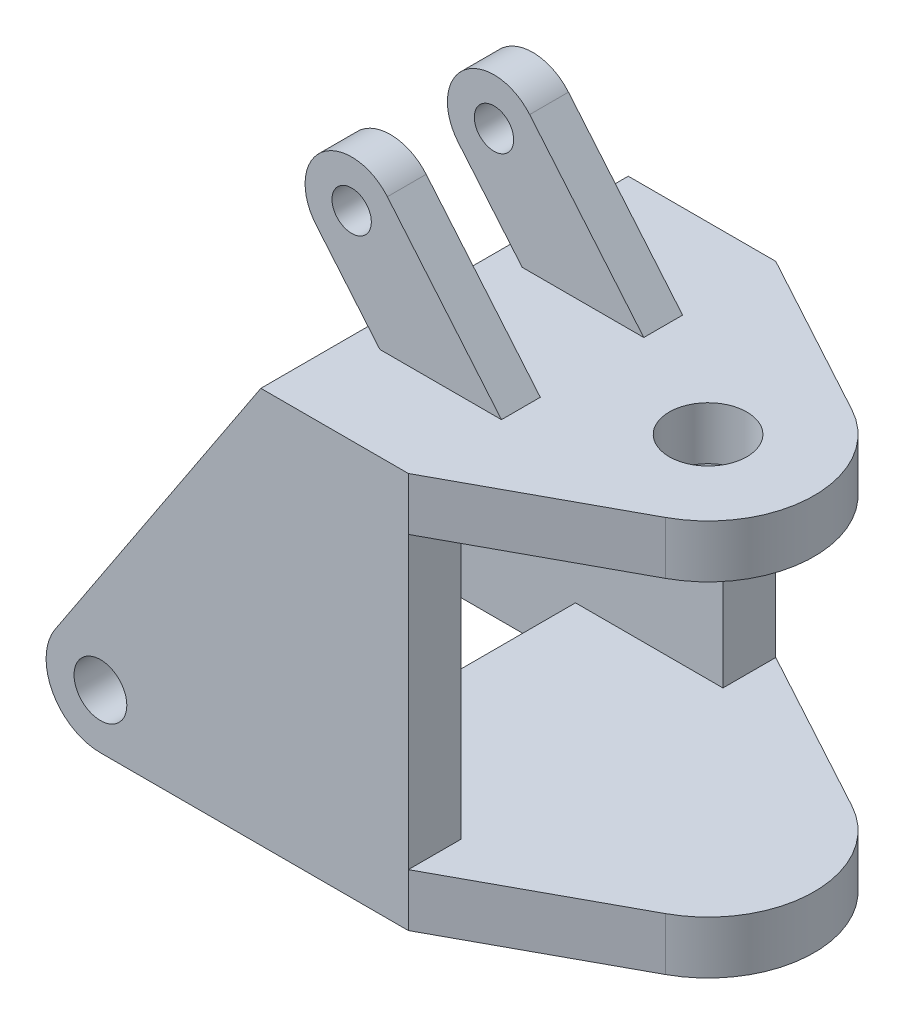
ISO-10303-21;
HEADER;
FILE_DESCRIPTION(('STEP AP214'),'2;1');
FILE_NAME('part.step','',(''),(''),'','','');
FILE_SCHEMA(('AUTOMOTIVE_DESIGN { 1 0 10303 214 1 1 1 1 }'));
ENDSEC;
DATA;
#1=APPLICATION_CONTEXT('core data for automotive mechanical design processes');
#2=APPLICATION_PROTOCOL_DEFINITION('international standard','automotive_design',2000,#1);
#3=PRODUCT_CONTEXT('',#1,'mechanical');
#4=PRODUCT('Part','Part','',(#3));
#5=PRODUCT_RELATED_PRODUCT_CATEGORY('part','',(#4));
#6=PRODUCT_DEFINITION_FORMATION('','',#4);
#7=PRODUCT_DEFINITION_CONTEXT('part definition',#1,'design');
#8=PRODUCT_DEFINITION('design','',#6,#7);
#9=PRODUCT_DEFINITION_SHAPE('','',#8);
#10=(LENGTH_UNIT() NAMED_UNIT(*) SI_UNIT(.MILLI.,.METRE.));
#11=(NAMED_UNIT(*) PLANE_ANGLE_UNIT() SI_UNIT($,.RADIAN.));
#12=(NAMED_UNIT(*) SI_UNIT($,.STERADIAN.) SOLID_ANGLE_UNIT());
#13=UNCERTAINTY_MEASURE_WITH_UNIT(LENGTH_MEASURE(1.E-05),#10,'distance_accuracy_value','');
#14=(GEOMETRIC_REPRESENTATION_CONTEXT(3) GLOBAL_UNCERTAINTY_ASSIGNED_CONTEXT((#13)) GLOBAL_UNIT_ASSIGNED_CONTEXT((#10,
#11,#12)) REPRESENTATION_CONTEXT('',''));
#15=CARTESIAN_POINT('',(0.,0.,0.));
#16=DIRECTION('',(0.,0.,1.));
#17=DIRECTION('',(1.,0.,0.));
#18=AXIS2_PLACEMENT_3D('',#15,#16,#17);
#19=CARTESIAN_POINT('',(-285.,765.,457.));
#20=DIRECTION('',(0.,-1.,0.));
#21=DIRECTION('',(0.,0.,-1.));
#22=AXIS2_PLACEMENT_3D('',#19,#20,#21);
#23=PLANE('',#22);
#24=DIRECTION('',(0.,0.,-1.));
#25=VECTOR('',#24,1.);
#26=CARTESIAN_POINT('',(-234.973312079811,765.,277.));
#27=LINE('',#26,#25);
#28=CARTESIAN_POINT('',(-234.973312079811,765.,277.));
#29=VERTEX_POINT('',#28);
#30=CARTESIAN_POINT('',(-234.973312079811,765.,202.));
#31=VERTEX_POINT('',#30);
#32=EDGE_CURVE('E285',#29,#31,#27,.T.);
#33=ORIENTED_EDGE('',*,*,#32,.T.);
#34=DIRECTION('',(1.,0.,0.));
#35=VECTOR('',#34,1.);
#36=CARTESIAN_POINT('',(-234.973312079811,765.,202.));
#37=LINE('',#36,#35);
#38=CARTESIAN_POINT('',(0.,765.,202.));
#39=VERTEX_POINT('',#38);
#40=EDGE_CURVE('E272',#31,#39,#37,.T.);
#41=ORIENTED_EDGE('',*,*,#40,.T.);
#42=DIRECTION('',(0.,0.,-1.));
#43=VECTOR('',#42,1.);
#44=CARTESIAN_POINT('',(0.,765.,277.));
#45=LINE('',#44,#43);
#46=CARTESIAN_POINT('',(0.,765.,277.));
#47=VERTEX_POINT('',#46);
#48=EDGE_CURVE('E282',#47,#39,#45,.T.);
#49=ORIENTED_EDGE('',*,*,#48,.F.);
#50=DIRECTION('',(1.,0.,0.));
#51=VECTOR('',#50,1.);
#52=CARTESIAN_POINT('',(-234.973312079811,765.,277.));
#53=LINE('',#52,#51);
#54=EDGE_CURVE('E56',#29,#47,#53,.T.);
#55=ORIENTED_EDGE('',*,*,#54,.F.);
#56=EDGE_LOOP('',(#33,#41,#49,#55));
#57=FACE_BOUND('',#56,.T.);
#58=DIRECTION('',(-0.878816619171536,0.,-0.477159669154794));
#59=VECTOR('',#58,1.);
#60=CARTESIAN_POINT('',(0.,765.,-253.));
#61=LINE('',#60,#59);
#62=CARTESIAN_POINT('',(322.019203343379,765.,-78.1574069301649));
#63=VERTEX_POINT('',#62);
#64=CARTESIAN_POINT('',(0.,765.,-253.));
#65=VERTEX_POINT('',#64);
#66=EDGE_CURVE('E389',#63,#65,#61,.T.);
#67=ORIENTED_EDGE('',*,*,#66,.T.);
#68=DIRECTION('',(-1.,0.,0.));
#69=VECTOR('',#68,1.);
#70=CARTESIAN_POINT('',(-285.,765.,-253.));
#71=LINE('',#70,#69);
#72=CARTESIAN_POINT('',(-285.,765.,-253.));
#73=VERTEX_POINT('',#72);
#74=EDGE_CURVE('E392',#65,#73,#71,.T.);
#75=ORIENTED_EDGE('',*,*,#74,.T.);
#76=DIRECTION('',(0.,0.,1.));
#77=VECTOR('',#76,1.);
#78=CARTESIAN_POINT('',(-285.,765.,457.));
#79=LINE('',#78,#77);
#80=CARTESIAN_POINT('',(-285.,765.,-151.));
#81=VERTEX_POINT('',#80);
#82=EDGE_CURVE('E375',#73,#81,#79,.T.);
#83=ORIENTED_EDGE('',*,*,#82,.T.);
#84=CARTESIAN_POINT('',(-285.,765.,355.));
#85=VERTEX_POINT('',#84);
#86=EDGE_CURVE('E394',#81,#85,#79,.T.);
#87=ORIENTED_EDGE('',*,*,#86,.T.);
#88=DIRECTION('',(0.,0.,-1.));
#89=VECTOR('',#88,1.);
#90=CARTESIAN_POINT('',(-285.,765.,457.));
#91=LINE('',#90,#89);
#92=CARTESIAN_POINT('',(-285.,765.,457.));
#93=VERTEX_POINT('',#92);
#94=EDGE_CURVE('E432',#93,#85,#91,.T.);
#95=ORIENTED_EDGE('',*,*,#94,.F.);
#96=DIRECTION('',(-1.,0.,0.));
#97=VECTOR('',#96,1.);
#98=CARTESIAN_POINT('',(-285.,765.,457.));
#99=LINE('',#98,#97);
#100=CARTESIAN_POINT('',(0.,765.,457.));
#101=VERTEX_POINT('',#100);
#102=EDGE_CURVE('E430',#101,#93,#99,.T.);
#103=ORIENTED_EDGE('',*,*,#102,.F.);
#104=DIRECTION('',(0.878816619171535,0.,-0.477159669154794));
#105=VECTOR('',#104,1.);
#106=CARTESIAN_POINT('',(322.019203343379,765.,282.157406930165));
#107=LINE('',#106,#105);
#108=CARTESIAN_POINT('',(322.019203343379,765.,282.157406930165));
#109=VERTEX_POINT('',#108);
#110=EDGE_CURVE('E368',#101,#109,#107,.T.);
#111=ORIENTED_EDGE('',*,*,#110,.T.);
#112=CARTESIAN_POINT('',(224.201471166647,765.,102.));
#113=DIRECTION('',(0.,1.,0.));
#114=DIRECTION('',(0.,0.,-1.));
#115=AXIS2_PLACEMENT_3D('',#112,#113,#114);
#116=CIRCLE('',#115,205.);
#117=EDGE_CURVE('E386',#109,#63,#116,.T.);
#118=ORIENTED_EDGE('',*,*,#117,.T.);
#119=EDGE_LOOP('',(#67,#75,#83,#87,#95,#103,#111,#118));
#120=FACE_BOUND('',#119,.T.);
#121=CARTESIAN_POINT('',(224.201471166647,765.,102.));
#122=DIRECTION('',(0.,1.,0.));
#123=DIRECTION('',(0.,0.,1.));
#124=AXIS2_PLACEMENT_3D('',#121,#122,#123);
#125=CIRCLE('',#124,75.);
#126=CARTESIAN_POINT('',(224.201471166647,765.,177.));
#127=VERTEX_POINT('',#126);
#128=EDGE_CURVE('E364',#127,#127,#125,.T.);
#129=ORIENTED_EDGE('',*,*,#128,.F.);
#130=EDGE_LOOP('',(#129));
#131=FACE_BOUND('',#130,.T.);
#132=DIRECTION('',(1.,0.,0.));
#133=VECTOR('',#132,1.);
#134=CARTESIAN_POINT('',(-234.973312079811,765.,-73.));
#135=LINE('',#134,#133);
#136=CARTESIAN_POINT('',(-234.973312079811,765.,-73.));
#137=VERTEX_POINT('',#136);
#138=CARTESIAN_POINT('',(0.,765.,-73.));
#139=VERTEX_POINT('',#138);
#140=EDGE_CURVE('E230',#137,#139,#135,.T.);
#141=ORIENTED_EDGE('',*,*,#140,.T.);
#142=DIRECTION('',(0.,0.,1.));
#143=VECTOR('',#142,1.);
#144=CARTESIAN_POINT('',(0.,765.,-73.));
#145=LINE('',#144,#143);
#146=CARTESIAN_POINT('',(0.,765.,1.99999999999997));
#147=VERTEX_POINT('',#146);
#148=EDGE_CURVE('E251',#139,#147,#145,.T.);
#149=ORIENTED_EDGE('',*,*,#148,.T.);
#150=DIRECTION('',(1.,0.,0.));
#151=VECTOR('',#150,1.);
#152=CARTESIAN_POINT('',(-234.973312079811,765.,1.99999999999997));
#153=LINE('',#152,#151);
#154=CARTESIAN_POINT('',(-234.973312079811,765.,1.99999999999999));
#155=VERTEX_POINT('',#154);
#156=EDGE_CURVE('E232',#155,#147,#153,.T.);
#157=ORIENTED_EDGE('',*,*,#156,.F.);
#158=DIRECTION('',(0.,0.,1.));
#159=VECTOR('',#158,1.);
#160=CARTESIAN_POINT('',(-234.973312079811,765.,-73.));
#161=LINE('',#160,#159);
#162=EDGE_CURVE('E241',#137,#155,#161,.T.);
#163=ORIENTED_EDGE('',*,*,#162,.F.);
#164=EDGE_LOOP('',(#141,#149,#157,#163));
#165=FACE_BOUND('',#164,.T.);
#166=ADVANCED_FACE('F33',(#57,#120,#131,#165),#23,.F.);
#167=CARTESIAN_POINT('',(0.,765.,457.));
#168=DIRECTION('',(-1.,0.,0.));
#169=DIRECTION('',(0.,0.,1.));
#170=AXIS2_PLACEMENT_3D('',#167,#168,#169);
#171=PLANE('',#170);
#172=DIRECTION('',(0.,0.,-1.));
#173=VECTOR('',#172,1.);
#174=CARTESIAN_POINT('',(0.,102.,457.));
#175=LINE('',#174,#173);
#176=CARTESIAN_POINT('',(0.,102.,457.));
#177=VERTEX_POINT('',#176);
#178=CARTESIAN_POINT('',(0.,102.,355.));
#179=VERTEX_POINT('',#178);
#180=EDGE_CURVE('E302',#177,#179,#175,.T.);
#181=ORIENTED_EDGE('',*,*,#180,.T.);
#182=DIRECTION('',(0.,1.,0.));
#183=VECTOR('',#182,1.);
#184=CARTESIAN_POINT('',(0.,765.,355.));
#185=LINE('',#184,#183);
#186=CARTESIAN_POINT('',(0.,663.,355.));
#187=VERTEX_POINT('',#186);
#188=EDGE_CURVE('E422',#179,#187,#185,.T.);
#189=ORIENTED_EDGE('',*,*,#188,.T.);
#190=DIRECTION('',(0.,0.,1.));
#191=VECTOR('',#190,1.);
#192=CARTESIAN_POINT('',(0.,663.,457.));
#193=LINE('',#192,#191);
#194=CARTESIAN_POINT('',(0.,663.,457.));
#195=VERTEX_POINT('',#194);
#196=EDGE_CURVE('E449',#187,#195,#193,.T.);
#197=ORIENTED_EDGE('',*,*,#196,.T.);
#198=DIRECTION('',(0.,1.,0.));
#199=VECTOR('',#198,1.);
#200=CARTESIAN_POINT('',(0.,765.,457.));
#201=LINE('',#200,#199);
#202=EDGE_CURVE('E426',#177,#195,#201,.T.);
#203=ORIENTED_EDGE('',*,*,#202,.F.);
#204=EDGE_LOOP('',(#181,#189,#197,#203));
#205=FACE_BOUND('',#204,.T.);
#206=ADVANCED_FACE('F515',(#205),#171,.F.);
#207=CARTESIAN_POINT('',(0.,765.,-253.));
#208=DIRECTION('',(1.,0.,0.));
#209=DIRECTION('',(0.,0.,-1.));
#210=AXIS2_PLACEMENT_3D('',#207,#208,#209);
#211=PLANE('',#210);
#212=DIRECTION('',(0.,1.,0.));
#213=VECTOR('',#212,1.);
#214=CARTESIAN_POINT('',(0.,765.,-151.));
#215=LINE('',#214,#213);
#216=CARTESIAN_POINT('',(0.,102.,-151.));
#217=VERTEX_POINT('',#216);
#218=CARTESIAN_POINT('',(0.,663.,-151.));
#219=VERTEX_POINT('',#218);
#220=EDGE_CURVE('E352',#217,#219,#215,.T.);
#221=ORIENTED_EDGE('',*,*,#220,.F.);
#222=DIRECTION('',(0.,0.,-1.));
#223=VECTOR('',#222,1.);
#224=CARTESIAN_POINT('',(0.,102.,-151.));
#225=LINE('',#224,#223);
#226=CARTESIAN_POINT('',(0.,102.,-253.));
#227=VERTEX_POINT('',#226);
#228=EDGE_CURVE('E290',#217,#227,#225,.T.);
#229=ORIENTED_EDGE('',*,*,#228,.T.);
#230=DIRECTION('',(0.,1.,0.));
#231=VECTOR('',#230,1.);
#232=CARTESIAN_POINT('',(0.,765.,-253.));
#233=LINE('',#232,#231);
#234=CARTESIAN_POINT('',(0.,663.,-253.));
#235=VERTEX_POINT('',#234);
#236=EDGE_CURVE('E338',#227,#235,#233,.T.);
#237=ORIENTED_EDGE('',*,*,#236,.T.);
#238=DIRECTION('',(0.,0.,1.));
#239=VECTOR('',#238,1.);
#240=CARTESIAN_POINT('',(0.,663.,102.));
#241=LINE('',#240,#239);
#242=EDGE_CURVE('E11',#235,#219,#241,.T.);
#243=ORIENTED_EDGE('',*,*,#242,.T.);
#244=EDGE_LOOP('',(#221,#229,#237,#243));
#245=FACE_BOUND('',#244,.T.);
#246=ADVANCED_FACE('F466',(#245),#211,.T.);
#247=CARTESIAN_POINT('',(-595.,105.,457.));
#248=DIRECTION('',(0.,0.,-1.));
#249=DIRECTION('',(-1.,0.,0.));
#250=AXIS2_PLACEMENT_3D('',#247,#248,#249);
#251=PLANE('',#250);
#252=ORIENTED_EDGE('',*,*,#102,.T.);
#253=DIRECTION('',(-0.551042356207036,-0.834477274505303,0.));
#254=VECTOR('',#253,1.);
#255=CARTESIAN_POINT('',(-682.620113823057,162.859447401739,457.));
#256=LINE('',#255,#254);
#257=CARTESIAN_POINT('',(-682.620113823057,162.859447401739,457.));
#258=VERTEX_POINT('',#257);
#259=EDGE_CURVE('E418',#93,#258,#256,.T.);
#260=ORIENTED_EDGE('',*,*,#259,.T.);
#261=CARTESIAN_POINT('',(-595.,105.,457.));
#262=DIRECTION('',(0.,0.,1.));
#263=DIRECTION('',(-1.,0.,0.));
#264=AXIS2_PLACEMENT_3D('',#261,#262,#263);
#265=CIRCLE('',#264,105.);
#266=CARTESIAN_POINT('',(-595.,0.,457.));
#267=VERTEX_POINT('',#266);
#268=EDGE_CURVE('E421',#258,#267,#265,.T.);
#269=ORIENTED_EDGE('',*,*,#268,.T.);
#270=DIRECTION('',(1.,0.,0.));
#271=VECTOR('',#270,1.);
#272=CARTESIAN_POINT('',(0.,0.,457.));
#273=LINE('',#272,#271);
#274=CARTESIAN_POINT('',(0.,0.,457.));
#275=VERTEX_POINT('',#274);
#276=EDGE_CURVE('E424',#267,#275,#273,.T.);
#277=ORIENTED_EDGE('',*,*,#276,.T.);
#278=EDGE_CURVE('E427',#275,#177,#201,.T.);
#279=ORIENTED_EDGE('',*,*,#278,.T.);
#280=ORIENTED_EDGE('',*,*,#202,.T.);
#281=DIRECTION('',(0.,1.,0.));
#282=VECTOR('',#281,1.);
#283=CARTESIAN_POINT('',(0.,663.,457.));
#284=LINE('',#283,#282);
#285=EDGE_CURVE('E397',#195,#101,#284,.T.);
#286=ORIENTED_EDGE('',*,*,#285,.T.);
#287=EDGE_LOOP('',(#252,#260,#269,#277,#279,#280,#286));
#288=FACE_BOUND('',#287,.T.);
#289=CARTESIAN_POINT('',(-595.,105.,457.));
#290=DIRECTION('',(0.,0.,1.));
#291=DIRECTION('',(1.,0.,0.));
#292=AXIS2_PLACEMENT_3D('',#289,#290,#291);
#293=CIRCLE('',#292,51.0000000000001);
#294=CARTESIAN_POINT('',(-544.,105.,457.));
#295=VERTEX_POINT('',#294);
#296=EDGE_CURVE('E412',#295,#295,#293,.T.);
#297=ORIENTED_EDGE('',*,*,#296,.F.);
#298=EDGE_LOOP('',(#297));
#299=FACE_BOUND('',#298,.T.);
#300=ADVANCED_FACE('F567',(#288,#299),#251,.F.);
#301=CARTESIAN_POINT('',(-595.,105.,355.));
#302=DIRECTION('',(0.,0.,-1.));
#303=DIRECTION('',(-1.,0.,0.));
#304=AXIS2_PLACEMENT_3D('',#301,#302,#303);
#305=PLANE('',#304);
#306=DIRECTION('',(0.,-1.,0.));
#307=VECTOR('',#306,1.);
#308=CARTESIAN_POINT('',(-285.,102.,355.));
#309=LINE('',#308,#307);
#310=CARTESIAN_POINT('',(-285.,102.,355.));
#311=VERTEX_POINT('',#310);
#312=CARTESIAN_POINT('',(-285.,0.,355.));
#313=VERTEX_POINT('',#312);
#314=EDGE_CURVE('E324',#311,#313,#309,.T.);
#315=ORIENTED_EDGE('',*,*,#314,.T.);
#316=DIRECTION('',(1.,0.,0.));
#317=VECTOR('',#316,1.);
#318=CARTESIAN_POINT('',(0.,0.,355.));
#319=LINE('',#318,#317);
#320=CARTESIAN_POINT('',(-595.,0.,355.));
#321=VERTEX_POINT('',#320);
#322=EDGE_CURVE('E437',#321,#313,#319,.T.);
#323=ORIENTED_EDGE('',*,*,#322,.F.);
#324=CARTESIAN_POINT('',(-595.,105.,355.));
#325=DIRECTION('',(0.,0.,1.));
#326=DIRECTION('',(-1.,0.,0.));
#327=AXIS2_PLACEMENT_3D('',#324,#325,#326);
#328=CIRCLE('',#327,105.);
#329=CARTESIAN_POINT('',(-682.620113823057,162.859447401739,355.));
#330=VERTEX_POINT('',#329);
#331=EDGE_CURVE('E435',#330,#321,#328,.T.);
#332=ORIENTED_EDGE('',*,*,#331,.F.);
#333=DIRECTION('',(-0.551042356207036,-0.834477274505303,0.));
#334=VECTOR('',#333,1.);
#335=CARTESIAN_POINT('',(-682.620113823057,162.859447401739,355.));
#336=LINE('',#335,#334);
#337=EDGE_CURVE('E415',#85,#330,#336,.T.);
#338=ORIENTED_EDGE('',*,*,#337,.F.);
#339=DIRECTION('',(0.,1.,0.));
#340=VECTOR('',#339,1.);
#341=CARTESIAN_POINT('',(-285.,105.,355.));
#342=LINE('',#341,#340);
#343=CARTESIAN_POINT('',(-285.,663.,355.));
#344=VERTEX_POINT('',#343);
#345=EDGE_CURVE('E400',#344,#85,#342,.T.);
#346=ORIENTED_EDGE('',*,*,#345,.F.);
#347=DIRECTION('',(-1.,0.,0.));
#348=VECTOR('',#347,1.);
#349=CARTESIAN_POINT('',(-595.,663.,355.));
#350=LINE('',#349,#348);
#351=EDGE_CURVE('E408',#187,#344,#350,.T.);
#352=ORIENTED_EDGE('',*,*,#351,.F.);
#353=ORIENTED_EDGE('',*,*,#188,.F.);
#354=DIRECTION('',(-1.,0.,0.));
#355=VECTOR('',#354,1.);
#356=CARTESIAN_POINT('',(0.,102.,355.));
#357=LINE('',#356,#355);
#358=EDGE_CURVE('E304',#179,#311,#357,.T.);
#359=ORIENTED_EDGE('',*,*,#358,.T.);
#360=EDGE_LOOP('',(#315,#323,#332,#338,#346,#352,#353,#359));
#361=FACE_BOUND('',#360,.T.);
#362=CARTESIAN_POINT('',(-595.,105.,355.));
#363=DIRECTION('',(0.,0.,1.));
#364=DIRECTION('',(1.,0.,0.));
#365=AXIS2_PLACEMENT_3D('',#362,#363,#364);
#366=CIRCLE('',#365,51.0000000000001);
#367=CARTESIAN_POINT('',(-544.,105.,355.));
#368=VERTEX_POINT('',#367);
#369=EDGE_CURVE('E411',#368,#368,#366,.T.);
#370=ORIENTED_EDGE('',*,*,#369,.T.);
#371=EDGE_LOOP('',(#370));
#372=FACE_BOUND('',#371,.T.);
#373=ADVANCED_FACE('F519',(#361,#372),#305,.T.);
#374=CARTESIAN_POINT('',(-682.620113823057,162.859447401739,457.));
#375=DIRECTION('',(0.834477274505303,-0.551042356207036,0.));
#376=DIRECTION('',(0.551042356207036,0.834477274505303,0.));
#377=AXIS2_PLACEMENT_3D('',#374,#375,#376);
#378=PLANE('',#377);
#379=ORIENTED_EDGE('',*,*,#337,.T.);
#380=DIRECTION('',(0.,0.,-1.));
#381=VECTOR('',#380,1.);
#382=CARTESIAN_POINT('',(-682.620113823057,162.859447401739,457.));
#383=LINE('',#382,#381);
#384=EDGE_CURVE('E446',#258,#330,#383,.T.);
#385=ORIENTED_EDGE('',*,*,#384,.F.);
#386=ORIENTED_EDGE('',*,*,#259,.F.);
#387=ORIENTED_EDGE('',*,*,#94,.T.);
#388=EDGE_LOOP('',(#379,#385,#386,#387));
#389=FACE_BOUND('',#388,.T.);
#390=ADVANCED_FACE('F35',(#389),#378,.F.);
#391=CARTESIAN_POINT('',(-595.,105.,457.));
#392=DIRECTION('',(0.,0.,-1.));
#393=DIRECTION('',(-1.,0.,0.));
#394=AXIS2_PLACEMENT_3D('',#391,#392,#393);
#395=CYLINDRICAL_SURFACE('',#394,105.);
#396=ORIENTED_EDGE('',*,*,#331,.T.);
#397=DIRECTION('',(0.,0.,-1.));
#398=VECTOR('',#397,1.);
#399=CARTESIAN_POINT('',(-595.,0.,457.));
#400=LINE('',#399,#398);
#401=EDGE_CURVE('E443',#267,#321,#400,.T.);
#402=ORIENTED_EDGE('',*,*,#401,.F.);
#403=ORIENTED_EDGE('',*,*,#268,.F.);
#404=ORIENTED_EDGE('',*,*,#384,.T.);
#405=EDGE_LOOP('',(#396,#402,#403,#404));
#406=FACE_BOUND('',#405,.T.);
#407=ADVANCED_FACE('F531',(#406),#395,.T.);
#408=CARTESIAN_POINT('',(0.,0.,457.));
#409=DIRECTION('',(0.,1.,0.));
#410=DIRECTION('',(-1.,0.,0.));
#411=AXIS2_PLACEMENT_3D('',#408,#409,#410);
#412=PLANE('',#411);
#413=ORIENTED_EDGE('',*,*,#322,.T.);
#414=DIRECTION('',(0.,0.,-1.));
#415=VECTOR('',#414,1.);
#416=CARTESIAN_POINT('',(-285.,0.,355.));
#417=LINE('',#416,#415);
#418=CARTESIAN_POINT('',(-285.,0.,-151.));
#419=VERTEX_POINT('',#418);
#420=EDGE_CURVE('E291',#313,#419,#417,.T.);
#421=ORIENTED_EDGE('',*,*,#420,.T.);
#422=DIRECTION('',(1.,0.,0.));
#423=VECTOR('',#422,1.);
#424=CARTESIAN_POINT('',(0.,0.,-151.));
#425=LINE('',#424,#423);
#426=CARTESIAN_POINT('',(-595.,0.,-151.));
#427=VERTEX_POINT('',#426);
#428=EDGE_CURVE('E354',#427,#419,#425,.T.);
#429=ORIENTED_EDGE('',*,*,#428,.F.);
#430=DIRECTION('',(0.,0.,1.));
#431=VECTOR('',#430,1.);
#432=CARTESIAN_POINT('',(-595.,0.,-253.));
#433=LINE('',#432,#431);
#434=CARTESIAN_POINT('',(-595.,0.,-253.));
#435=VERTEX_POINT('',#434);
#436=EDGE_CURVE('E359',#435,#427,#433,.T.);
#437=ORIENTED_EDGE('',*,*,#436,.F.);
#438=DIRECTION('',(1.,0.,0.));
#439=VECTOR('',#438,1.);
#440=CARTESIAN_POINT('',(0.,0.,-253.));
#441=LINE('',#440,#439);
#442=CARTESIAN_POINT('',(0.,0.,-253.));
#443=VERTEX_POINT('',#442);
#444=EDGE_CURVE('E343',#435,#443,#441,.T.);
#445=ORIENTED_EDGE('',*,*,#444,.T.);
#446=DIRECTION('',(0.878816619171536,0.,0.477159669154794));
#447=VECTOR('',#446,1.);
#448=CARTESIAN_POINT('',(0.,0.,-253.));
#449=LINE('',#448,#447);
#450=CARTESIAN_POINT('',(322.01920334338,0.,-78.1574069301649));
#451=VERTEX_POINT('',#450);
#452=EDGE_CURVE('E287',#443,#451,#449,.T.);
#453=ORIENTED_EDGE('',*,*,#452,.T.);
#454=CARTESIAN_POINT('',(224.201471166647,0.,102.));
#455=DIRECTION('',(0.,-1.,0.));
#456=DIRECTION('',(1.,0.,0.));
#457=AXIS2_PLACEMENT_3D('',#454,#455,#456);
#458=CIRCLE('',#457,205.);
#459=CARTESIAN_POINT('',(322.01920334338,0.,282.157406930165));
#460=VERTEX_POINT('',#459);
#461=EDGE_CURVE('E312',#451,#460,#458,.T.);
#462=ORIENTED_EDGE('',*,*,#461,.T.);
#463=DIRECTION('',(-0.878816619171536,0.,0.477159669154794));
#464=VECTOR('',#463,1.);
#465=CARTESIAN_POINT('',(322.01920334338,0.,282.157406930165));
#466=LINE('',#465,#464);
#467=EDGE_CURVE('E315',#460,#275,#466,.T.);
#468=ORIENTED_EDGE('',*,*,#467,.T.);
#469=ORIENTED_EDGE('',*,*,#276,.F.);
#470=ORIENTED_EDGE('',*,*,#401,.T.);
#471=EDGE_LOOP('',(#413,#421,#429,#437,#445,#453,#462,#468,#469,#470));
#472=FACE_BOUND('',#471,.T.);
#473=ADVANCED_FACE('F490',(#472),#412,.F.);
#474=CARTESIAN_POINT('',(-595.,105.,457.));
#475=DIRECTION('',(0.,0.,-1.));
#476=DIRECTION('',(-1.,0.,0.));
#477=AXIS2_PLACEMENT_3D('',#474,#475,#476);
#478=CYLINDRICAL_SURFACE('',#477,51.0000000000001);
#479=ORIENTED_EDGE('',*,*,#296,.T.);
#480=EDGE_LOOP('',(#479));
#481=FACE_BOUND('',#480,.T.);
#482=ORIENTED_EDGE('',*,*,#369,.F.);
#483=EDGE_LOOP('',(#482));
#484=FACE_BOUND('',#483,.T.);
#485=ADVANCED_FACE('F547',(#481,#484),#478,.F.);
#486=CARTESIAN_POINT('',(322.019203343379,663.,282.157406930165));
#487=DIRECTION('',(0.477159669154794,0.,0.878816619171536));
#488=DIRECTION('',(0.878816619171536,0.,-0.477159669154794));
#489=AXIS2_PLACEMENT_3D('',#486,#487,#488);
#490=PLANE('',#489);
#491=ORIENTED_EDGE('',*,*,#110,.F.);
#492=ORIENTED_EDGE('',*,*,#285,.F.);
#493=DIRECTION('',(0.878816619171535,0.,-0.477159669154794));
#494=VECTOR('',#493,1.);
#495=CARTESIAN_POINT('',(322.019203343379,663.,282.157406930165));
#496=LINE('',#495,#494);
#497=CARTESIAN_POINT('',(322.019203343379,663.,282.157406930165));
#498=VERTEX_POINT('',#497);
#499=EDGE_CURVE('E371',#195,#498,#496,.T.);
#500=ORIENTED_EDGE('',*,*,#499,.T.);
#501=DIRECTION('',(0.,1.,0.));
#502=VECTOR('',#501,1.);
#503=CARTESIAN_POINT('',(322.019203343379,663.,282.157406930165));
#504=LINE('',#503,#502);
#505=EDGE_CURVE('E383',#498,#109,#504,.T.);
#506=ORIENTED_EDGE('',*,*,#505,.T.);
#507=EDGE_LOOP('',(#491,#492,#500,#506));
#508=FACE_BOUND('',#507,.T.);
#509=ADVANCED_FACE('F510',(#508),#490,.T.);
#510=CARTESIAN_POINT('',(-285.,663.,457.));
#511=DIRECTION('',(-1.,0.,0.));
#512=DIRECTION('',(0.,0.,1.));
#513=AXIS2_PLACEMENT_3D('',#510,#511,#512);
#514=PLANE('',#513);
#515=DIRECTION('',(0.,1.,0.));
#516=VECTOR('',#515,1.);
#517=CARTESIAN_POINT('',(-285.,663.,-151.));
#518=LINE('',#517,#516);
#519=CARTESIAN_POINT('',(-285.,663.,-151.));
#520=VERTEX_POINT('',#519);
#521=EDGE_CURVE('E361',#520,#81,#518,.T.);
#522=ORIENTED_EDGE('',*,*,#521,.F.);
#523=DIRECTION('',(0.,0.,1.));
#524=VECTOR('',#523,1.);
#525=CARTESIAN_POINT('',(-285.,663.,457.));
#526=LINE('',#525,#524);
#527=EDGE_CURVE('E381',#520,#344,#526,.T.);
#528=ORIENTED_EDGE('',*,*,#527,.T.);
#529=ORIENTED_EDGE('',*,*,#345,.T.);
#530=ORIENTED_EDGE('',*,*,#86,.F.);
#531=EDGE_LOOP('',(#522,#528,#529,#530));
#532=FACE_BOUND('',#531,.T.);
#533=ADVANCED_FACE('F539',(#532),#514,.T.);
#534=CARTESIAN_POINT('',(-285.,663.,-253.));
#535=DIRECTION('',(0.,0.,-1.));
#536=DIRECTION('',(-1.,0.,0.));
#537=AXIS2_PLACEMENT_3D('',#534,#535,#536);
#538=PLANE('',#537);
#539=DIRECTION('',(-0.551042356207036,-0.834477274505303,0.));
#540=VECTOR('',#539,1.);
#541=CARTESIAN_POINT('',(-682.620113823057,162.859447401739,-253.));
#542=LINE('',#541,#540);
#543=CARTESIAN_POINT('',(-682.620113823057,162.859447401739,-253.));
#544=VERTEX_POINT('',#543);
#545=EDGE_CURVE('E335',#73,#544,#542,.T.);
#546=ORIENTED_EDGE('',*,*,#545,.F.);
#547=ORIENTED_EDGE('',*,*,#74,.F.);
#548=DIRECTION('',(0.,1.,0.));
#549=VECTOR('',#548,1.);
#550=CARTESIAN_POINT('',(0.,663.,-253.));
#551=LINE('',#550,#549);
#552=EDGE_CURVE('E401',#235,#65,#551,.T.);
#553=ORIENTED_EDGE('',*,*,#552,.F.);
#554=ORIENTED_EDGE('',*,*,#236,.F.);
#555=EDGE_CURVE('E340',#443,#227,#233,.T.);
#556=ORIENTED_EDGE('',*,*,#555,.F.);
#557=ORIENTED_EDGE('',*,*,#444,.F.);
#558=CARTESIAN_POINT('',(-595.,105.,-253.));
#559=DIRECTION('',(0.,0.,1.));
#560=DIRECTION('',(-1.,0.,0.));
#561=AXIS2_PLACEMENT_3D('',#558,#559,#560);
#562=CIRCLE('',#561,105.);
#563=EDGE_CURVE('E346',#544,#435,#562,.T.);
#564=ORIENTED_EDGE('',*,*,#563,.F.);
#565=EDGE_LOOP('',(#546,#547,#553,#554,#556,#557,#564));
#566=FACE_BOUND('',#565,.T.);
#567=CARTESIAN_POINT('',(-595.,105.,-253.));
#568=DIRECTION('',(0.,0.,1.));
#569=DIRECTION('',(1.,0.,0.));
#570=AXIS2_PLACEMENT_3D('',#567,#568,#569);
#571=CIRCLE('',#570,51.0000000000001);
#572=CARTESIAN_POINT('',(-544.,105.,-253.));
#573=VERTEX_POINT('',#572);
#574=EDGE_CURVE('E329',#573,#573,#571,.T.);
#575=ORIENTED_EDGE('',*,*,#574,.T.);
#576=EDGE_LOOP('',(#575));
#577=FACE_BOUND('',#576,.T.);
#578=ADVANCED_FACE('F471',(#566,#577),#538,.T.);
#579=CARTESIAN_POINT('',(0.,663.,-253.));
#580=DIRECTION('',(0.477159669154794,0.,-0.878816619171536));
#581=DIRECTION('',(-0.878816619171536,0.,-0.477159669154794));
#582=AXIS2_PLACEMENT_3D('',#579,#580,#581);
#583=PLANE('',#582);
#584=ORIENTED_EDGE('',*,*,#66,.F.);
#585=DIRECTION('',(0.,1.,0.));
#586=VECTOR('',#585,1.);
#587=CARTESIAN_POINT('',(322.019203343379,663.,-78.1574069301649));
#588=LINE('',#587,#586);
#589=CARTESIAN_POINT('',(322.019203343379,663.,-78.1574069301649));
#590=VERTEX_POINT('',#589);
#591=EDGE_CURVE('E403',#590,#63,#588,.T.);
#592=ORIENTED_EDGE('',*,*,#591,.F.);
#593=DIRECTION('',(-0.878816619171536,0.,-0.477159669154794));
#594=VECTOR('',#593,1.);
#595=CARTESIAN_POINT('',(0.,663.,-253.));
#596=LINE('',#595,#594);
#597=EDGE_CURVE('E378',#590,#235,#596,.T.);
#598=ORIENTED_EDGE('',*,*,#597,.T.);
#599=ORIENTED_EDGE('',*,*,#552,.T.);
#600=EDGE_LOOP('',(#584,#592,#598,#599));
#601=FACE_BOUND('',#600,.T.);
#602=ADVANCED_FACE('F504',(#601),#583,.T.);
#603=CARTESIAN_POINT('',(224.201471166647,663.,102.));
#604=DIRECTION('',(0.,1.,0.));
#605=DIRECTION('',(0.,0.,1.));
#606=AXIS2_PLACEMENT_3D('',#603,#604,#605);
#607=CYLINDRICAL_SURFACE('',#606,205.);
#608=ORIENTED_EDGE('',*,*,#117,.F.);
#609=ORIENTED_EDGE('',*,*,#505,.F.);
#610=CARTESIAN_POINT('',(224.201471166647,663.,102.));
#611=DIRECTION('',(0.,1.,0.));
#612=DIRECTION('',(0.,0.,-1.));
#613=AXIS2_PLACEMENT_3D('',#610,#611,#612);
#614=CIRCLE('',#613,205.);
#615=EDGE_CURVE('E374',#498,#590,#614,.T.);
#616=ORIENTED_EDGE('',*,*,#615,.T.);
#617=ORIENTED_EDGE('',*,*,#591,.T.);
#618=EDGE_LOOP('',(#608,#609,#616,#617));
#619=FACE_BOUND('',#618,.T.);
#620=ADVANCED_FACE('F508',(#619),#607,.T.);
#621=CARTESIAN_POINT('',(224.201471166647,663.,102.));
#622=DIRECTION('',(0.,-1.,0.));
#623=DIRECTION('',(0.,0.,-1.));
#624=AXIS2_PLACEMENT_3D('',#621,#622,#623);
#625=PLANE('',#624);
#626=ORIENTED_EDGE('',*,*,#242,.F.);
#627=ORIENTED_EDGE('',*,*,#597,.F.);
#628=ORIENTED_EDGE('',*,*,#615,.F.);
#629=ORIENTED_EDGE('',*,*,#499,.F.);
#630=ORIENTED_EDGE('',*,*,#196,.F.);
#631=ORIENTED_EDGE('',*,*,#351,.T.);
#632=ORIENTED_EDGE('',*,*,#527,.F.);
#633=DIRECTION('',(-1.,0.,0.));
#634=VECTOR('',#633,1.);
#635=CARTESIAN_POINT('',(224.201471166647,663.,-151.));
#636=LINE('',#635,#634);
#637=EDGE_CURVE('E41',#219,#520,#636,.T.);
#638=ORIENTED_EDGE('',*,*,#637,.F.);
#639=EDGE_LOOP('',(#626,#627,#628,#629,#630,#631,#632,#638));
#640=FACE_BOUND('',#639,.T.);
#641=CARTESIAN_POINT('',(224.201471166647,663.,102.));
#642=DIRECTION('',(0.,1.,0.));
#643=DIRECTION('',(0.,0.,1.));
#644=AXIS2_PLACEMENT_3D('',#641,#642,#643);
#645=CIRCLE('',#644,75.);
#646=CARTESIAN_POINT('',(224.201471166647,663.,177.));
#647=VERTEX_POINT('',#646);
#648=EDGE_CURVE('E365',#647,#647,#645,.T.);
#649=ORIENTED_EDGE('',*,*,#648,.T.);
#650=EDGE_LOOP('',(#649));
#651=FACE_BOUND('',#650,.T.);
#652=ADVANCED_FACE('F461',(#640,#651),#625,.T.);
#653=CARTESIAN_POINT('',(224.201471166647,663.,102.));
#654=DIRECTION('',(0.,1.,0.));
#655=DIRECTION('',(0.,0.,1.));
#656=AXIS2_PLACEMENT_3D('',#653,#654,#655);
#657=CYLINDRICAL_SURFACE('',#656,75.);
#658=ORIENTED_EDGE('',*,*,#648,.F.);
#659=EDGE_LOOP('',(#658));
#660=FACE_BOUND('',#659,.T.);
#661=ORIENTED_EDGE('',*,*,#128,.T.);
#662=EDGE_LOOP('',(#661));
#663=FACE_BOUND('',#662,.T.);
#664=ADVANCED_FACE('F600',(#660,#663),#657,.F.);
#665=CARTESIAN_POINT('',(-682.620113823057,162.859447401739,-253.));
#666=DIRECTION('',(-0.834477274505303,0.551042356207036,0.));
#667=DIRECTION('',(-0.551042356207036,-0.834477274505303,0.));
#668=AXIS2_PLACEMENT_3D('',#665,#666,#667);
#669=PLANE('',#668);
#670=DIRECTION('',(-0.551042356207036,-0.834477274505303,0.));
#671=VECTOR('',#670,1.);
#672=CARTESIAN_POINT('',(-682.620113823057,162.859447401739,-151.));
#673=LINE('',#672,#671);
#674=CARTESIAN_POINT('',(-682.620113823057,162.859447401739,-151.));
#675=VERTEX_POINT('',#674);
#676=EDGE_CURVE('E332',#81,#675,#673,.T.);
#677=ORIENTED_EDGE('',*,*,#676,.F.);
#678=ORIENTED_EDGE('',*,*,#82,.F.);
#679=ORIENTED_EDGE('',*,*,#545,.T.);
#680=DIRECTION('',(0.,0.,1.));
#681=VECTOR('',#680,1.);
#682=CARTESIAN_POINT('',(-682.620113823057,162.859447401739,-253.));
#683=LINE('',#682,#681);
#684=EDGE_CURVE('E349',#544,#675,#683,.T.);
#685=ORIENTED_EDGE('',*,*,#684,.T.);
#686=EDGE_LOOP('',(#677,#678,#679,#685));
#687=FACE_BOUND('',#686,.T.);
#688=ADVANCED_FACE('F498',(#687),#669,.T.);
#689=CARTESIAN_POINT('',(-595.,105.,-253.));
#690=DIRECTION('',(0.,0.,1.));
#691=DIRECTION('',(1.,0.,0.));
#692=AXIS2_PLACEMENT_3D('',#689,#690,#691);
#693=CYLINDRICAL_SURFACE('',#692,105.);
#694=CARTESIAN_POINT('',(-595.,105.,-151.));
#695=DIRECTION('',(0.,0.,1.));
#696=DIRECTION('',(-1.,0.,0.));
#697=AXIS2_PLACEMENT_3D('',#694,#695,#696);
#698=CIRCLE('',#697,105.);
#699=EDGE_CURVE('E339',#675,#427,#698,.T.);
#700=ORIENTED_EDGE('',*,*,#699,.F.);
#701=ORIENTED_EDGE('',*,*,#684,.F.);
#702=ORIENTED_EDGE('',*,*,#563,.T.);
#703=ORIENTED_EDGE('',*,*,#436,.T.);
#704=EDGE_LOOP('',(#700,#701,#702,#703));
#705=FACE_BOUND('',#704,.T.);
#706=ADVANCED_FACE('F495',(#705),#693,.T.);
#707=CARTESIAN_POINT('',(-595.,105.,-151.));
#708=DIRECTION('',(0.,0.,1.));
#709=DIRECTION('',(-1.,0.,0.));
#710=AXIS2_PLACEMENT_3D('',#707,#708,#709);
#711=PLANE('',#710);
#712=DIRECTION('',(0.,-1.,0.));
#713=VECTOR('',#712,1.);
#714=CARTESIAN_POINT('',(-285.,102.,-151.));
#715=LINE('',#714,#713);
#716=CARTESIAN_POINT('',(-285.,102.,-151.));
#717=VERTEX_POINT('',#716);
#718=EDGE_CURVE('E320',#717,#419,#715,.T.);
#719=ORIENTED_EDGE('',*,*,#718,.F.);
#720=DIRECTION('',(1.,0.,0.));
#721=VECTOR('',#720,1.);
#722=CARTESIAN_POINT('',(-285.,102.,-151.));
#723=LINE('',#722,#721);
#724=EDGE_CURVE('E288',#717,#217,#723,.T.);
#725=ORIENTED_EDGE('',*,*,#724,.T.);
#726=ORIENTED_EDGE('',*,*,#220,.T.);
#727=ORIENTED_EDGE('',*,*,#637,.T.);
#728=ORIENTED_EDGE('',*,*,#521,.T.);
#729=ORIENTED_EDGE('',*,*,#676,.T.);
#730=ORIENTED_EDGE('',*,*,#699,.T.);
#731=ORIENTED_EDGE('',*,*,#428,.T.);
#732=EDGE_LOOP('',(#719,#725,#726,#727,#728,#729,#730,#731));
#733=FACE_BOUND('',#732,.T.);
#734=CARTESIAN_POINT('',(-595.,105.,-151.));
#735=DIRECTION('',(0.,0.,1.));
#736=DIRECTION('',(1.,0.,0.));
#737=AXIS2_PLACEMENT_3D('',#734,#735,#736);
#738=CIRCLE('',#737,51.0000000000001);
#739=CARTESIAN_POINT('',(-544.,105.,-151.));
#740=VERTEX_POINT('',#739);
#741=EDGE_CURVE('E323',#740,#740,#738,.T.);
#742=ORIENTED_EDGE('',*,*,#741,.F.);
#743=EDGE_LOOP('',(#742));
#744=FACE_BOUND('',#743,.T.);
#745=ADVANCED_FACE('F454',(#733,#744),#711,.T.);
#746=CARTESIAN_POINT('',(-595.,105.,-253.));
#747=DIRECTION('',(0.,0.,1.));
#748=DIRECTION('',(1.,0.,0.));
#749=AXIS2_PLACEMENT_3D('',#746,#747,#748);
#750=CYLINDRICAL_SURFACE('',#749,51.0000000000001);
#751=ORIENTED_EDGE('',*,*,#574,.F.);
#752=EDGE_LOOP('',(#751));
#753=FACE_BOUND('',#752,.T.);
#754=ORIENTED_EDGE('',*,*,#741,.T.);
#755=EDGE_LOOP('',(#754));
#756=FACE_BOUND('',#755,.T.);
#757=ADVANCED_FACE('F625',(#753,#756),#750,.F.);
#758=CARTESIAN_POINT('',(-285.,102.,355.));
#759=DIRECTION('',(-1.,0.,0.));
#760=DIRECTION('',(0.,-1.,0.));
#761=AXIS2_PLACEMENT_3D('',#758,#759,#760);
#762=PLANE('',#761);
#763=ORIENTED_EDGE('',*,*,#420,.F.);
#764=ORIENTED_EDGE('',*,*,#314,.F.);
#765=DIRECTION('',(0.,0.,-1.));
#766=VECTOR('',#765,1.);
#767=CARTESIAN_POINT('',(-285.,102.,355.));
#768=LINE('',#767,#766);
#769=EDGE_CURVE('E306',#311,#717,#768,.T.);
#770=ORIENTED_EDGE('',*,*,#769,.T.);
#771=ORIENTED_EDGE('',*,*,#718,.T.);
#772=EDGE_LOOP('',(#763,#764,#770,#771));
#773=FACE_BOUND('',#772,.T.);
#774=ADVANCED_FACE('F526',(#773),#762,.T.);
#775=CARTESIAN_POINT('',(322.01920334338,102.,282.157406930165));
#776=DIRECTION('',(0.477159669154794,0.,0.878816619171536));
#777=DIRECTION('',(0.878816619171536,0.,-0.477159669154794));
#778=AXIS2_PLACEMENT_3D('',#775,#776,#777);
#779=PLANE('',#778);
#780=ORIENTED_EDGE('',*,*,#467,.F.);
#781=DIRECTION('',(0.,-1.,0.));
#782=VECTOR('',#781,1.);
#783=CARTESIAN_POINT('',(322.01920334338,102.,282.157406930165));
#784=LINE('',#783,#782);
#785=CARTESIAN_POINT('',(322.01920334338,102.,282.157406930165));
#786=VERTEX_POINT('',#785);
#787=EDGE_CURVE('E326',#786,#460,#784,.T.);
#788=ORIENTED_EDGE('',*,*,#787,.F.);
#789=DIRECTION('',(-0.878816619171536,0.,0.477159669154794));
#790=VECTOR('',#789,1.);
#791=CARTESIAN_POINT('',(322.01920334338,102.,282.157406930165));
#792=LINE('',#791,#790);
#793=EDGE_CURVE('E299',#786,#177,#792,.T.);
#794=ORIENTED_EDGE('',*,*,#793,.T.);
#795=ORIENTED_EDGE('',*,*,#278,.F.);
#796=EDGE_LOOP('',(#780,#788,#794,#795));
#797=FACE_BOUND('',#796,.T.);
#798=ADVANCED_FACE('F639',(#797),#779,.T.);
#799=CARTESIAN_POINT('',(224.201471166647,102.,102.));
#800=DIRECTION('',(0.,-1.,0.));
#801=DIRECTION('',(1.,0.,0.));
#802=AXIS2_PLACEMENT_3D('',#799,#800,#801);
#803=CYLINDRICAL_SURFACE('',#802,205.);
#804=ORIENTED_EDGE('',*,*,#461,.F.);
#805=DIRECTION('',(0.,-1.,0.));
#806=VECTOR('',#805,1.);
#807=CARTESIAN_POINT('',(322.01920334338,102.,-78.1574069301649));
#808=LINE('',#807,#806);
#809=CARTESIAN_POINT('',(322.01920334338,102.,-78.1574069301649));
#810=VERTEX_POINT('',#809);
#811=EDGE_CURVE('E309',#810,#451,#808,.T.);
#812=ORIENTED_EDGE('',*,*,#811,.F.);
#813=CARTESIAN_POINT('',(224.201471166647,102.,102.));
#814=DIRECTION('',(0.,-1.,0.));
#815=DIRECTION('',(1.,0.,0.));
#816=AXIS2_PLACEMENT_3D('',#813,#814,#815);
#817=CIRCLE('',#816,205.);
#818=EDGE_CURVE('E296',#810,#786,#817,.T.);
#819=ORIENTED_EDGE('',*,*,#818,.T.);
#820=ORIENTED_EDGE('',*,*,#787,.T.);
#821=EDGE_LOOP('',(#804,#812,#819,#820));
#822=FACE_BOUND('',#821,.T.);
#823=ADVANCED_FACE('F487',(#822),#803,.T.);
#824=CARTESIAN_POINT('',(0.,102.,-253.));
#825=DIRECTION('',(0.477159669154794,0.,-0.878816619171536));
#826=DIRECTION('',(-0.878816619171536,0.,-0.477159669154794));
#827=AXIS2_PLACEMENT_3D('',#824,#825,#826);
#828=PLANE('',#827);
#829=ORIENTED_EDGE('',*,*,#452,.F.);
#830=ORIENTED_EDGE('',*,*,#555,.T.);
#831=DIRECTION('',(0.878816619171536,0.,0.477159669154794));
#832=VECTOR('',#831,1.);
#833=CARTESIAN_POINT('',(0.,102.,-253.));
#834=LINE('',#833,#832);
#835=EDGE_CURVE('E293',#227,#810,#834,.T.);
#836=ORIENTED_EDGE('',*,*,#835,.T.);
#837=ORIENTED_EDGE('',*,*,#811,.T.);
#838=EDGE_LOOP('',(#829,#830,#836,#837));
#839=FACE_BOUND('',#838,.T.);
#840=ADVANCED_FACE('F478',(#839),#828,.T.);
#841=CARTESIAN_POINT('',(224.201471166647,102.,102.));
#842=DIRECTION('',(0.,-1.,0.));
#843=DIRECTION('',(1.,0.,0.));
#844=AXIS2_PLACEMENT_3D('',#841,#842,#843);
#845=PLANE('',#844);
#846=ORIENTED_EDGE('',*,*,#724,.F.);
#847=ORIENTED_EDGE('',*,*,#769,.F.);
#848=ORIENTED_EDGE('',*,*,#358,.F.);
#849=ORIENTED_EDGE('',*,*,#180,.F.);
#850=ORIENTED_EDGE('',*,*,#793,.F.);
#851=ORIENTED_EDGE('',*,*,#818,.F.);
#852=ORIENTED_EDGE('',*,*,#835,.F.);
#853=ORIENTED_EDGE('',*,*,#228,.F.);
#854=EDGE_LOOP('',(#846,#847,#848,#849,#850,#851,#852,#853));
#855=FACE_BOUND('',#854,.T.);
#856=ADVANCED_FACE('F482',(#855),#845,.F.);
#857=CARTESIAN_POINT('',(-289.50208043125,970.,277.));
#858=DIRECTION('',(0.,0.,-1.));
#859=DIRECTION('',(-1.,0.,0.));
#860=AXIS2_PLACEMENT_3D('',#857,#858,#859);
#861=PLANE('',#860);
#862=DIRECTION('',(0.642787609686544,-0.766044443118974,0.));
#863=VECTOR('',#862,1.);
#864=CARTESIAN_POINT('',(-234.973312079811,765.,277.));
#865=LINE('',#864,#863);
#866=CARTESIAN_POINT('',(-358.446080311958,912.149115128211,277.));
#867=VERTEX_POINT('',#866);
#868=EDGE_CURVE('E261',#867,#29,#865,.T.);
#869=ORIENTED_EDGE('',*,*,#868,.T.);
#870=ORIENTED_EDGE('',*,*,#54,.T.);
#871=DIRECTION('',(-0.642787609686544,0.766044443118974,0.));
#872=VECTOR('',#871,1.);
#873=CARTESIAN_POINT('',(0.,765.,277.));
#874=LINE('',#873,#872);
#875=CARTESIAN_POINT('',(-220.558080550542,1027.85088487179,277.));
#876=VERTEX_POINT('',#875);
#877=EDGE_CURVE('E265',#47,#876,#874,.T.);
#878=ORIENTED_EDGE('',*,*,#877,.T.);
#879=CARTESIAN_POINT('',(-289.50208043125,970.,277.));
#880=DIRECTION('',(0.,0.,1.));
#881=DIRECTION('',(-1.,0.,0.));
#882=AXIS2_PLACEMENT_3D('',#879,#880,#881);
#883=CIRCLE('',#882,90.);
#884=EDGE_CURVE('E267',#876,#867,#883,.T.);
#885=ORIENTED_EDGE('',*,*,#884,.T.);
#886=EDGE_LOOP('',(#869,#870,#878,#885));
#887=FACE_BOUND('',#886,.T.);
#888=CARTESIAN_POINT('',(-289.50208043125,970.,277.));
#889=DIRECTION('',(0.,0.,1.));
#890=DIRECTION('',(1.,0.,0.));
#891=AXIS2_PLACEMENT_3D('',#888,#889,#890);
#892=CIRCLE('',#891,38.);
#893=CARTESIAN_POINT('',(-251.50208043125,970.,277.));
#894=VERTEX_POINT('',#893);
#895=EDGE_CURVE('E255',#894,#894,#892,.T.);
#896=ORIENTED_EDGE('',*,*,#895,.F.);
#897=EDGE_LOOP('',(#896));
#898=FACE_BOUND('',#897,.T.);
#899=ADVANCED_FACE('F665',(#887,#898),#861,.F.);
#900=CARTESIAN_POINT('',(-289.50208043125,970.,202.));
#901=DIRECTION('',(0.,0.,-1.));
#902=DIRECTION('',(-1.,0.,0.));
#903=AXIS2_PLACEMENT_3D('',#900,#901,#902);
#904=PLANE('',#903);
#905=DIRECTION('',(0.642787609686544,-0.766044443118974,0.));
#906=VECTOR('',#905,1.);
#907=CARTESIAN_POINT('',(-234.973312079811,765.,202.));
#908=LINE('',#907,#906);
#909=CARTESIAN_POINT('',(-358.446080311958,912.149115128211,202.));
#910=VERTEX_POINT('',#909);
#911=EDGE_CURVE('E258',#910,#31,#908,.T.);
#912=ORIENTED_EDGE('',*,*,#911,.F.);
#913=CARTESIAN_POINT('',(-289.50208043125,970.,202.));
#914=DIRECTION('',(0.,0.,1.));
#915=DIRECTION('',(-1.,0.,0.));
#916=AXIS2_PLACEMENT_3D('',#913,#914,#915);
#917=CIRCLE('',#916,90.);
#918=CARTESIAN_POINT('',(-220.558080550542,1027.85088487179,202.));
#919=VERTEX_POINT('',#918);
#920=EDGE_CURVE('E263',#919,#910,#917,.T.);
#921=ORIENTED_EDGE('',*,*,#920,.F.);
#922=DIRECTION('',(-0.642787609686544,0.766044443118974,0.));
#923=VECTOR('',#922,1.);
#924=CARTESIAN_POINT('',(0.,765.,202.));
#925=LINE('',#924,#923);
#926=EDGE_CURVE('E274',#39,#919,#925,.T.);
#927=ORIENTED_EDGE('',*,*,#926,.F.);
#928=ORIENTED_EDGE('',*,*,#40,.F.);
#929=EDGE_LOOP('',(#912,#921,#927,#928));
#930=FACE_BOUND('',#929,.T.);
#931=CARTESIAN_POINT('',(-289.50208043125,970.,202.));
#932=DIRECTION('',(0.,0.,1.));
#933=DIRECTION('',(1.,0.,0.));
#934=AXIS2_PLACEMENT_3D('',#931,#932,#933);
#935=CIRCLE('',#934,38.);
#936=CARTESIAN_POINT('',(-251.50208043125,970.,202.));
#937=VERTEX_POINT('',#936);
#938=EDGE_CURVE('E220',#937,#937,#935,.T.);
#939=ORIENTED_EDGE('',*,*,#938,.T.);
#940=EDGE_LOOP('',(#939));
#941=FACE_BOUND('',#940,.T.);
#942=ADVANCED_FACE('F672',(#930,#941),#904,.T.);
#943=CARTESIAN_POINT('',(-234.973312079811,765.,277.));
#944=DIRECTION('',(0.766044443118974,0.642787609686544,0.));
#945=DIRECTION('',(-0.642787609686544,0.766044443118974,0.));
#946=AXIS2_PLACEMENT_3D('',#943,#944,#945);
#947=PLANE('',#946);
#948=ORIENTED_EDGE('',*,*,#911,.T.);
#949=ORIENTED_EDGE('',*,*,#32,.F.);
#950=ORIENTED_EDGE('',*,*,#868,.F.);
#951=DIRECTION('',(0.,0.,-1.));
#952=VECTOR('',#951,1.);
#953=CARTESIAN_POINT('',(-358.446080311958,912.149115128211,277.));
#954=LINE('',#953,#952);
#955=EDGE_CURVE('E269',#867,#910,#954,.T.);
#956=ORIENTED_EDGE('',*,*,#955,.T.);
#957=EDGE_LOOP('',(#948,#949,#950,#956));
#958=FACE_BOUND('',#957,.T.);
#959=ADVANCED_FACE('F680',(#958),#947,.F.);
#960=CARTESIAN_POINT('',(0.,765.,277.));
#961=DIRECTION('',(-0.766044443118974,-0.642787609686544,0.));
#962=DIRECTION('',(0.642787609686544,-0.766044443118974,0.));
#963=AXIS2_PLACEMENT_3D('',#960,#961,#962);
#964=PLANE('',#963);
#965=ORIENTED_EDGE('',*,*,#926,.T.);
#966=DIRECTION('',(0.,0.,-1.));
#967=VECTOR('',#966,1.);
#968=CARTESIAN_POINT('',(-220.558080550542,1027.85088487179,277.));
#969=LINE('',#968,#967);
#970=EDGE_CURVE('E279',#876,#919,#969,.T.);
#971=ORIENTED_EDGE('',*,*,#970,.F.);
#972=ORIENTED_EDGE('',*,*,#877,.F.);
#973=ORIENTED_EDGE('',*,*,#48,.T.);
#974=EDGE_LOOP('',(#965,#971,#972,#973));
#975=FACE_BOUND('',#974,.T.);
#976=ADVANCED_FACE('F688',(#975),#964,.F.);
#977=CARTESIAN_POINT('',(-289.50208043125,970.,277.));
#978=DIRECTION('',(0.,0.,-1.));
#979=DIRECTION('',(-1.,0.,0.));
#980=AXIS2_PLACEMENT_3D('',#977,#978,#979);
#981=CYLINDRICAL_SURFACE('',#980,90.);
#982=ORIENTED_EDGE('',*,*,#920,.T.);
#983=ORIENTED_EDGE('',*,*,#955,.F.);
#984=ORIENTED_EDGE('',*,*,#884,.F.);
#985=ORIENTED_EDGE('',*,*,#970,.T.);
#986=EDGE_LOOP('',(#982,#983,#984,#985));
#987=FACE_BOUND('',#986,.T.);
#988=ADVANCED_FACE('F696',(#987),#981,.T.);
#989=CARTESIAN_POINT('',(-289.50208043125,970.,277.));
#990=DIRECTION('',(0.,0.,-1.));
#991=DIRECTION('',(-1.,0.,0.));
#992=AXIS2_PLACEMENT_3D('',#989,#990,#991);
#993=CYLINDRICAL_SURFACE('',#992,38.);
#994=ORIENTED_EDGE('',*,*,#895,.T.);
#995=EDGE_LOOP('',(#994));
#996=FACE_BOUND('',#995,.T.);
#997=ORIENTED_EDGE('',*,*,#938,.F.);
#998=EDGE_LOOP('',(#997));
#999=FACE_BOUND('',#998,.T.);
#1000=ADVANCED_FACE('F704',(#996,#999),#993,.F.);
#1001=CARTESIAN_POINT('',(-234.973312079811,765.,-73.));
#1002=DIRECTION('',(-0.766044443118974,-0.642787609686544,0.));
#1003=DIRECTION('',(0.642787609686544,-0.766044443118974,0.));
#1004=AXIS2_PLACEMENT_3D('',#1001,#1002,#1003);
#1005=PLANE('',#1004);
#1006=DIRECTION('',(0.642787609686544,-0.766044443118974,0.));
#1007=VECTOR('',#1006,1.);
#1008=CARTESIAN_POINT('',(-234.973312079811,765.,1.99999999999997));
#1009=LINE('',#1008,#1007);
#1010=CARTESIAN_POINT('',(-358.446080311958,912.149115128211,1.99999999999997));
#1011=VERTEX_POINT('',#1010);
#1012=EDGE_CURVE('E48',#1011,#155,#1009,.T.);
#1013=ORIENTED_EDGE('',*,*,#1012,.F.);
#1014=DIRECTION('',(0.,0.,1.));
#1015=VECTOR('',#1014,1.);
#1016=CARTESIAN_POINT('',(-358.446080311958,912.149115128211,-73.));
#1017=LINE('',#1016,#1015);
#1018=CARTESIAN_POINT('',(-358.446080311958,912.149115128211,-73.));
#1019=VERTEX_POINT('',#1018);
#1020=EDGE_CURVE('E212',#1019,#1011,#1017,.T.);
#1021=ORIENTED_EDGE('',*,*,#1020,.F.);
#1022=DIRECTION('',(0.642787609686544,-0.766044443118974,0.));
#1023=VECTOR('',#1022,1.);
#1024=CARTESIAN_POINT('',(-234.973312079811,765.,-73.));
#1025=LINE('',#1024,#1023);
#1026=EDGE_CURVE('E215',#1019,#137,#1025,.T.);
#1027=ORIENTED_EDGE('',*,*,#1026,.T.);
#1028=ORIENTED_EDGE('',*,*,#162,.T.);
#1029=EDGE_LOOP('',(#1013,#1021,#1027,#1028));
#1030=FACE_BOUND('',#1029,.T.);
#1031=ADVANCED_FACE('F214',(#1030),#1005,.T.);
#1032=CARTESIAN_POINT('',(-289.50208043125,970.,-73.));
#1033=DIRECTION('',(0.,0.,1.));
#1034=DIRECTION('',(1.,0.,0.));
#1035=AXIS2_PLACEMENT_3D('',#1032,#1033,#1034);
#1036=CYLINDRICAL_SURFACE('',#1035,90.);
#1037=CARTESIAN_POINT('',(-289.50208043125,970.,1.99999999999997));
#1038=DIRECTION('',(0.,0.,1.));
#1039=DIRECTION('',(-1.,0.,0.));
#1040=AXIS2_PLACEMENT_3D('',#1037,#1038,#1039);
#1041=CIRCLE('',#1040,90.);
#1042=CARTESIAN_POINT('',(-220.558080550542,1027.85088487179,1.99999999999997));
#1043=VERTEX_POINT('',#1042);
#1044=EDGE_CURVE('E243',#1043,#1011,#1041,.T.);
#1045=ORIENTED_EDGE('',*,*,#1044,.F.);
#1046=DIRECTION('',(0.,0.,1.));
#1047=VECTOR('',#1046,1.);
#1048=CARTESIAN_POINT('',(-220.558080550542,1027.85088487179,-73.));
#1049=LINE('',#1048,#1047);
#1050=CARTESIAN_POINT('',(-220.558080550542,1027.85088487179,-73.));
#1051=VERTEX_POINT('',#1050);
#1052=EDGE_CURVE('E221',#1051,#1043,#1049,.T.);
#1053=ORIENTED_EDGE('',*,*,#1052,.F.);
#1054=CARTESIAN_POINT('',(-289.50208043125,970.,-73.));
#1055=DIRECTION('',(0.,0.,1.));
#1056=DIRECTION('',(-1.,0.,0.));
#1057=AXIS2_PLACEMENT_3D('',#1054,#1055,#1056);
#1058=CIRCLE('',#1057,90.);
#1059=EDGE_CURVE('E227',#1051,#1019,#1058,.T.);
#1060=ORIENTED_EDGE('',*,*,#1059,.T.);
#1061=ORIENTED_EDGE('',*,*,#1020,.T.);
#1062=EDGE_LOOP('',(#1045,#1053,#1060,#1061));
#1063=FACE_BOUND('',#1062,.T.);
#1064=ADVANCED_FACE('F234',(#1063),#1036,.T.);
#1065=CARTESIAN_POINT('',(0.,765.,-73.));
#1066=DIRECTION('',(0.766044443118974,0.642787609686544,0.));
#1067=DIRECTION('',(-0.642787609686544,0.766044443118974,0.));
#1068=AXIS2_PLACEMENT_3D('',#1065,#1066,#1067);
#1069=PLANE('',#1068);
#1070=DIRECTION('',(-0.642787609686544,0.766044443118974,0.));
#1071=VECTOR('',#1070,1.);
#1072=CARTESIAN_POINT('',(0.,765.,1.99999999999997));
#1073=LINE('',#1072,#1071);
#1074=EDGE_CURVE('E246',#147,#1043,#1073,.T.);
#1075=ORIENTED_EDGE('',*,*,#1074,.F.);
#1076=ORIENTED_EDGE('',*,*,#148,.F.);
#1077=DIRECTION('',(-0.642787609686544,0.766044443118974,0.));
#1078=VECTOR('',#1077,1.);
#1079=CARTESIAN_POINT('',(0.,765.,-73.));
#1080=LINE('',#1079,#1078);
#1081=EDGE_CURVE('E235',#139,#1051,#1080,.T.);
#1082=ORIENTED_EDGE('',*,*,#1081,.T.);
#1083=ORIENTED_EDGE('',*,*,#1052,.T.);
#1084=EDGE_LOOP('',(#1075,#1076,#1082,#1083));
#1085=FACE_BOUND('',#1084,.T.);
#1086=ADVANCED_FACE('F725',(#1085),#1069,.T.);
#1087=CARTESIAN_POINT('',(-289.50208043125,970.,-73.));
#1088=DIRECTION('',(0.,0.,1.));
#1089=DIRECTION('',(-1.,0.,0.));
#1090=AXIS2_PLACEMENT_3D('',#1087,#1088,#1089);
#1091=PLANE('',#1090);
#1092=CARTESIAN_POINT('',(-289.50208043125,970.,-73.));
#1093=DIRECTION('',(0.,0.,1.));
#1094=DIRECTION('',(1.,0.,0.));
#1095=AXIS2_PLACEMENT_3D('',#1092,#1093,#1094);
#1096=CIRCLE('',#1095,38.);
#1097=CARTESIAN_POINT('',(-251.50208043125,970.,-73.));
#1098=VERTEX_POINT('',#1097);
#1099=EDGE_CURVE('E244',#1098,#1098,#1096,.T.);
#1100=ORIENTED_EDGE('',*,*,#1099,.T.);
#1101=EDGE_LOOP('',(#1100));
#1102=FACE_BOUND('',#1101,.T.);
#1103=ORIENTED_EDGE('',*,*,#1026,.F.);
#1104=ORIENTED_EDGE('',*,*,#1059,.F.);
#1105=ORIENTED_EDGE('',*,*,#1081,.F.);
#1106=ORIENTED_EDGE('',*,*,#140,.F.);
#1107=EDGE_LOOP('',(#1103,#1104,#1105,#1106));
#1108=FACE_BOUND('',#1107,.T.);
#1109=ADVANCED_FACE('F225',(#1102,#1108),#1091,.F.);
#1110=CARTESIAN_POINT('',(-289.50208043125,970.,1.99999999999997));
#1111=DIRECTION('',(0.,0.,1.));
#1112=DIRECTION('',(-1.,0.,0.));
#1113=AXIS2_PLACEMENT_3D('',#1110,#1111,#1112);
#1114=PLANE('',#1113);
#1115=CARTESIAN_POINT('',(-289.50208043125,970.,1.99999999999997));
#1116=DIRECTION('',(0.,0.,1.));
#1117=DIRECTION('',(1.,0.,0.));
#1118=AXIS2_PLACEMENT_3D('',#1115,#1116,#1117);
#1119=CIRCLE('',#1118,38.);
#1120=CARTESIAN_POINT('',(-251.50208043125,970.,1.99999999999997));
#1121=VERTEX_POINT('',#1120);
#1122=EDGE_CURVE('E881',#1121,#1121,#1119,.T.);
#1123=ORIENTED_EDGE('',*,*,#1122,.F.);
#1124=EDGE_LOOP('',(#1123));
#1125=FACE_BOUND('',#1124,.T.);
#1126=ORIENTED_EDGE('',*,*,#1012,.T.);
#1127=ORIENTED_EDGE('',*,*,#156,.T.);
#1128=ORIENTED_EDGE('',*,*,#1074,.T.);
#1129=ORIENTED_EDGE('',*,*,#1044,.T.);
#1130=EDGE_LOOP('',(#1126,#1127,#1128,#1129));
#1131=FACE_BOUND('',#1130,.T.);
#1132=ADVANCED_FACE('F739',(#1125,#1131),#1114,.T.);
#1133=CARTESIAN_POINT('',(-289.50208043125,970.,-73.));
#1134=DIRECTION('',(0.,0.,1.));
#1135=DIRECTION('',(1.,0.,0.));
#1136=AXIS2_PLACEMENT_3D('',#1133,#1134,#1135);
#1137=CYLINDRICAL_SURFACE('',#1136,38.);
#1138=ORIENTED_EDGE('',*,*,#1099,.F.);
#1139=EDGE_LOOP('',(#1138));
#1140=FACE_BOUND('',#1139,.T.);
#1141=ORIENTED_EDGE('',*,*,#1122,.T.);
#1142=EDGE_LOOP('',(#1141));
#1143=FACE_BOUND('',#1142,.T.);
#1144=ADVANCED_FACE('F747',(#1140,#1143),#1137,.F.);
#1145=CLOSED_SHELL('',(#166,#206,#246,#300,#373,#390,#407,#473,#485,#509,#533,#578,#602,#620,
#652,#664,#688,#706,#745,#757,#774,#798,#823,#840,#856,#899,#942,#959,#976,#988,#1000,#1031,
#1064,#1086,#1109,#1132,#1144));
#1146=MANIFOLD_SOLID_BREP('B2',#1145);
#1147=ADVANCED_BREP_SHAPE_REPRESENTATION('',(#18,#1146),#14);
#1148=SHAPE_DEFINITION_REPRESENTATION(#9,#1147);
ENDSEC;
END-ISO-10303-21;
